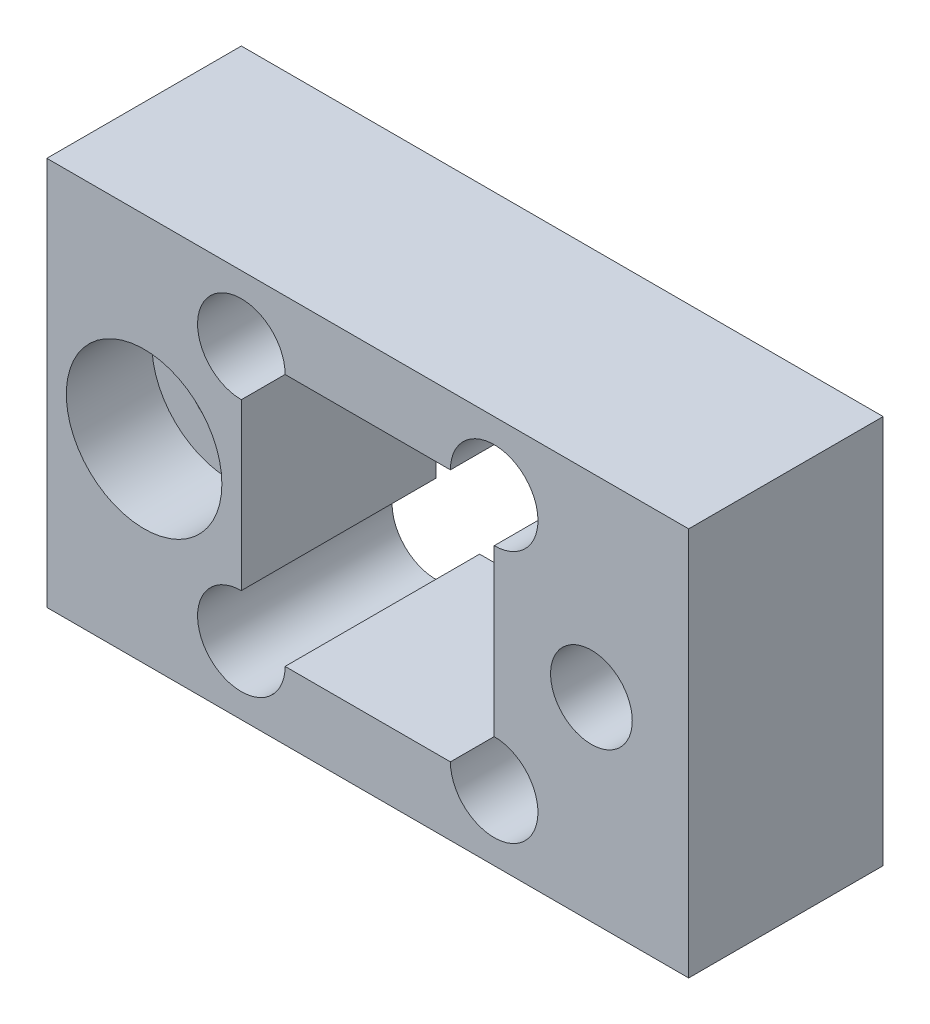
ISO-10303-21;
HEADER;
FILE_DESCRIPTION(('STEP AP214'),'2;1');
FILE_NAME('part.step','',(''),(''),'','','');
FILE_SCHEMA(('AUTOMOTIVE_DESIGN { 1 0 10303 214 1 1 1 1 }'));
ENDSEC;
DATA;
#1=APPLICATION_CONTEXT('core data for automotive mechanical design processes');
#2=APPLICATION_PROTOCOL_DEFINITION('international standard','automotive_design',2000,#1);
#3=PRODUCT_CONTEXT('',#1,'mechanical');
#4=PRODUCT('Part','Part','',(#3));
#5=PRODUCT_RELATED_PRODUCT_CATEGORY('part','',(#4));
#6=PRODUCT_DEFINITION_FORMATION('','',#4);
#7=PRODUCT_DEFINITION_CONTEXT('part definition',#1,'design');
#8=PRODUCT_DEFINITION('design','',#6,#7);
#9=PRODUCT_DEFINITION_SHAPE('','',#8);
#10=(LENGTH_UNIT() NAMED_UNIT(*) SI_UNIT(.MILLI.,.METRE.));
#11=(NAMED_UNIT(*) PLANE_ANGLE_UNIT() SI_UNIT($,.RADIAN.));
#12=(NAMED_UNIT(*) SI_UNIT($,.STERADIAN.) SOLID_ANGLE_UNIT());
#13=UNCERTAINTY_MEASURE_WITH_UNIT(LENGTH_MEASURE(1.E-05),#10,'distance_accuracy_value','');
#14=(GEOMETRIC_REPRESENTATION_CONTEXT(3) GLOBAL_UNCERTAINTY_ASSIGNED_CONTEXT((#13)) GLOBAL_UNIT_ASSIGNED_CONTEXT((#10,
#11,#12)) REPRESENTATION_CONTEXT('',''));
#15=CARTESIAN_POINT('',(0.,0.,0.));
#16=DIRECTION('',(0.,0.,1.));
#17=DIRECTION('',(1.,0.,0.));
#18=AXIS2_PLACEMENT_3D('',#15,#16,#17);
#19=CARTESIAN_POINT('',(0.,0.,10.));
#20=DIRECTION('',(0.,0.,-1.));
#21=DIRECTION('',(-1.,0.,0.));
#22=AXIS2_PLACEMENT_3D('',#19,#20,#21);
#23=PLANE('',#22);
#24=CARTESIAN_POINT('',(11.5,0.,10.));
#25=DIRECTION('',(0.,0.,1.));
#26=DIRECTION('',(1.,0.,0.));
#27=AXIS2_PLACEMENT_3D('',#24,#25,#26);
#28=CIRCLE('',#27,2.09999999999999);
#29=CARTESIAN_POINT('',(13.6,0.,10.));
#30=VERTEX_POINT('',#29);
#31=EDGE_CURVE('E241',#30,#30,#28,.T.);
#32=ORIENTED_EDGE('',*,*,#31,.F.);
#33=EDGE_LOOP('',(#32));
#34=FACE_BOUND('',#33,.T.);
#35=CARTESIAN_POINT('',(-11.5,0.,10.));
#36=DIRECTION('',(0.,0.,1.));
#37=DIRECTION('',(1.,0.,0.));
#38=AXIS2_PLACEMENT_3D('',#35,#36,#37);
#39=CIRCLE('',#38,4.);
#40=CARTESIAN_POINT('',(-7.5,0.,10.));
#41=VERTEX_POINT('',#40);
#42=EDGE_CURVE('E220',#41,#41,#39,.T.);
#43=ORIENTED_EDGE('',*,*,#42,.F.);
#44=EDGE_LOOP('',(#43));
#45=FACE_BOUND('',#44,.T.);
#46=DIRECTION('',(0.,-1.,0.));
#47=VECTOR('',#46,1.);
#48=CARTESIAN_POINT('',(-16.5,-10.,10.));
#49=LINE('',#48,#47);
#50=CARTESIAN_POINT('',(-16.5,10.,10.));
#51=VERTEX_POINT('',#50);
#52=CARTESIAN_POINT('',(-16.5,-10.,10.));
#53=VERTEX_POINT('',#52);
#54=EDGE_CURVE('E170',#51,#53,#49,.T.);
#55=ORIENTED_EDGE('',*,*,#54,.T.);
#56=DIRECTION('',(1.,0.,0.));
#57=VECTOR('',#56,1.);
#58=CARTESIAN_POINT('',(-16.5,-10.,10.));
#59=LINE('',#58,#57);
#60=CARTESIAN_POINT('',(16.5,-10.,10.));
#61=VERTEX_POINT('',#60);
#62=EDGE_CURVE('E173',#53,#61,#59,.T.);
#63=ORIENTED_EDGE('',*,*,#62,.T.);
#64=DIRECTION('',(0.,1.,0.));
#65=VECTOR('',#64,1.);
#66=CARTESIAN_POINT('',(16.5,-10.,10.));
#67=LINE('',#66,#65);
#68=CARTESIAN_POINT('',(16.5,10.,10.));
#69=VERTEX_POINT('',#68);
#70=EDGE_CURVE('E176',#61,#69,#67,.T.);
#71=ORIENTED_EDGE('',*,*,#70,.T.);
#72=DIRECTION('',(-1.,0.,0.));
#73=VECTOR('',#72,1.);
#74=CARTESIAN_POINT('',(-16.5,10.,10.));
#75=LINE('',#74,#73);
#76=EDGE_CURVE('E178',#69,#51,#75,.T.);
#77=ORIENTED_EDGE('',*,*,#76,.T.);
#78=EDGE_LOOP('',(#55,#63,#71,#77));
#79=FACE_BOUND('',#78,.T.);
#80=DIRECTION('',(-1.,0.,0.));
#81=VECTOR('',#80,1.);
#82=CARTESIAN_POINT('',(-6.5,6.5,10.));
#83=LINE('',#82,#81);
#84=CARTESIAN_POINT('',(4.24999999999999,6.5,10.));
#85=VERTEX_POINT('',#84);
#86=CARTESIAN_POINT('',(-4.25,6.5,10.));
#87=VERTEX_POINT('',#86);
#88=EDGE_CURVE('E149',#85,#87,#83,.T.);
#89=ORIENTED_EDGE('',*,*,#88,.F.);
#90=CARTESIAN_POINT('',(6.5,6.5,10.));
#91=DIRECTION('',(0.,0.,1.));
#92=DIRECTION('',(1.,0.,0.));
#93=AXIS2_PLACEMENT_3D('',#90,#91,#92);
#94=CIRCLE('',#93,2.25);
#95=CARTESIAN_POINT('',(6.5,4.25,10.));
#96=VERTEX_POINT('',#95);
#97=EDGE_CURVE('E51',#96,#85,#94,.T.);
#98=ORIENTED_EDGE('',*,*,#97,.F.);
#99=DIRECTION('',(0.,1.,0.));
#100=VECTOR('',#99,1.);
#101=CARTESIAN_POINT('',(6.5,6.5,10.));
#102=LINE('',#101,#100);
#103=CARTESIAN_POINT('',(6.5,-4.25,10.));
#104=VERTEX_POINT('',#103);
#105=EDGE_CURVE('E154',#104,#96,#102,.T.);
#106=ORIENTED_EDGE('',*,*,#105,.F.);
#107=CARTESIAN_POINT('',(6.5,-6.5,10.));
#108=DIRECTION('',(0.,0.,1.));
#109=DIRECTION('',(1.,0.,0.));
#110=AXIS2_PLACEMENT_3D('',#107,#108,#109);
#111=CIRCLE('',#110,2.25);
#112=CARTESIAN_POINT('',(4.25,-6.5,10.));
#113=VERTEX_POINT('',#112);
#114=EDGE_CURVE('E237',#113,#104,#111,.T.);
#115=ORIENTED_EDGE('',*,*,#114,.F.);
#116=DIRECTION('',(1.,0.,0.));
#117=VECTOR('',#116,1.);
#118=CARTESIAN_POINT('',(-6.5,-6.5,10.));
#119=LINE('',#118,#117);
#120=CARTESIAN_POINT('',(-4.25,-6.5,10.));
#121=VERTEX_POINT('',#120);
#122=EDGE_CURVE('E145',#121,#113,#119,.T.);
#123=ORIENTED_EDGE('',*,*,#122,.F.);
#124=CARTESIAN_POINT('',(-6.5,-6.5,10.));
#125=DIRECTION('',(0.,0.,1.));
#126=DIRECTION('',(1.,0.,0.));
#127=AXIS2_PLACEMENT_3D('',#124,#125,#126);
#128=CIRCLE('',#127,2.25);
#129=CARTESIAN_POINT('',(-6.5,-4.25,10.));
#130=VERTEX_POINT('',#129);
#131=EDGE_CURVE('E127',#130,#121,#128,.T.);
#132=ORIENTED_EDGE('',*,*,#131,.F.);
#133=DIRECTION('',(0.,-1.,0.));
#134=VECTOR('',#133,1.);
#135=CARTESIAN_POINT('',(-6.5,6.5,10.));
#136=LINE('',#135,#134);
#137=CARTESIAN_POINT('',(-6.5,4.25,10.));
#138=VERTEX_POINT('',#137);
#139=EDGE_CURVE('E142',#138,#130,#136,.T.);
#140=ORIENTED_EDGE('',*,*,#139,.F.);
#141=CARTESIAN_POINT('',(-6.5,6.5,10.));
#142=DIRECTION('',(0.,0.,1.));
#143=DIRECTION('',(1.,0.,0.));
#144=AXIS2_PLACEMENT_3D('',#141,#142,#143);
#145=CIRCLE('',#144,2.25);
#146=EDGE_CURVE('E59',#87,#138,#145,.T.);
#147=ORIENTED_EDGE('',*,*,#146,.F.);
#148=EDGE_LOOP('',(#89,#98,#106,#115,#123,#132,#140,#147));
#149=FACE_BOUND('',#148,.T.);
#150=ADVANCED_FACE('F37',(#34,#45,#79,#149),#23,.F.);
#151=CARTESIAN_POINT('',(0.,0.,0.));
#152=DIRECTION('',(0.,0.,-1.));
#153=DIRECTION('',(-1.,0.,0.));
#154=AXIS2_PLACEMENT_3D('',#151,#152,#153);
#155=PLANE('',#154);
#156=CARTESIAN_POINT('',(11.5,0.,0.));
#157=DIRECTION('',(0.,0.,1.));
#158=DIRECTION('',(1.,0.,0.));
#159=AXIS2_PLACEMENT_3D('',#156,#157,#158);
#160=CIRCLE('',#159,2.1);
#161=CARTESIAN_POINT('',(13.6,0.,0.));
#162=VERTEX_POINT('',#161);
#163=EDGE_CURVE('E239',#162,#162,#160,.T.);
#164=ORIENTED_EDGE('',*,*,#163,.T.);
#165=EDGE_LOOP('',(#164));
#166=FACE_BOUND('',#165,.T.);
#167=CARTESIAN_POINT('',(6.5,6.5,0.));
#168=DIRECTION('',(0.,0.,1.));
#169=DIRECTION('',(1.,0.,0.));
#170=AXIS2_PLACEMENT_3D('',#167,#168,#169);
#171=CIRCLE('',#170,2.25);
#172=CARTESIAN_POINT('',(6.5,4.25,0.));
#173=VERTEX_POINT('',#172);
#174=CARTESIAN_POINT('',(4.25,6.5,0.));
#175=VERTEX_POINT('',#174);
#176=EDGE_CURVE('E238',#173,#175,#171,.T.);
#177=ORIENTED_EDGE('',*,*,#176,.T.);
#178=DIRECTION('',(-1.,0.,0.));
#179=VECTOR('',#178,1.);
#180=CARTESIAN_POINT('',(-6.5,6.5,0.));
#181=LINE('',#180,#179);
#182=CARTESIAN_POINT('',(-4.25,6.5,0.));
#183=VERTEX_POINT('',#182);
#184=EDGE_CURVE('E161',#175,#183,#181,.T.);
#185=ORIENTED_EDGE('',*,*,#184,.T.);
#186=CARTESIAN_POINT('',(-6.5,6.5,0.));
#187=DIRECTION('',(0.,0.,1.));
#188=DIRECTION('',(1.,0.,0.));
#189=AXIS2_PLACEMENT_3D('',#186,#187,#188);
#190=CIRCLE('',#189,2.25);
#191=CARTESIAN_POINT('',(-6.5,4.25,0.));
#192=VERTEX_POINT('',#191);
#193=EDGE_CURVE('E136',#183,#192,#190,.T.);
#194=ORIENTED_EDGE('',*,*,#193,.T.);
#195=DIRECTION('',(0.,-1.,0.));
#196=VECTOR('',#195,1.);
#197=CARTESIAN_POINT('',(-6.5,6.5,0.));
#198=LINE('',#197,#196);
#199=CARTESIAN_POINT('',(-6.5,-4.25,0.));
#200=VERTEX_POINT('',#199);
#201=EDGE_CURVE('E165',#192,#200,#198,.T.);
#202=ORIENTED_EDGE('',*,*,#201,.T.);
#203=CARTESIAN_POINT('',(-6.5,-6.5,0.));
#204=DIRECTION('',(0.,0.,1.));
#205=DIRECTION('',(1.,0.,0.));
#206=AXIS2_PLACEMENT_3D('',#203,#204,#205);
#207=CIRCLE('',#206,2.25);
#208=CARTESIAN_POINT('',(-4.25,-6.5,0.));
#209=VERTEX_POINT('',#208);
#210=EDGE_CURVE('E130',#200,#209,#207,.T.);
#211=ORIENTED_EDGE('',*,*,#210,.T.);
#212=DIRECTION('',(1.,0.,0.));
#213=VECTOR('',#212,1.);
#214=CARTESIAN_POINT('',(-6.5,-6.5,0.));
#215=LINE('',#214,#213);
#216=CARTESIAN_POINT('',(4.25,-6.5,0.));
#217=VERTEX_POINT('',#216);
#218=EDGE_CURVE('E167',#209,#217,#215,.T.);
#219=ORIENTED_EDGE('',*,*,#218,.T.);
#220=CARTESIAN_POINT('',(6.5,-6.5,0.));
#221=DIRECTION('',(0.,0.,1.));
#222=DIRECTION('',(1.,0.,0.));
#223=AXIS2_PLACEMENT_3D('',#220,#221,#222);
#224=CIRCLE('',#223,2.25);
#225=CARTESIAN_POINT('',(6.5,-4.25,0.));
#226=VERTEX_POINT('',#225);
#227=EDGE_CURVE('E146',#217,#226,#224,.T.);
#228=ORIENTED_EDGE('',*,*,#227,.T.);
#229=DIRECTION('',(0.,1.,0.));
#230=VECTOR('',#229,1.);
#231=CARTESIAN_POINT('',(6.5,6.5,0.));
#232=LINE('',#231,#230);
#233=EDGE_CURVE('E158',#226,#173,#232,.T.);
#234=ORIENTED_EDGE('',*,*,#233,.T.);
#235=EDGE_LOOP('',(#177,#185,#194,#202,#211,#219,#228,#234));
#236=FACE_BOUND('',#235,.T.);
#237=CARTESIAN_POINT('',(-11.5,0.,0.));
#238=DIRECTION('',(0.,0.,1.));
#239=DIRECTION('',(1.,0.,0.));
#240=AXIS2_PLACEMENT_3D('',#237,#238,#239);
#241=CIRCLE('',#240,2.25);
#242=CARTESIAN_POINT('',(-9.25,0.,0.));
#243=VERTEX_POINT('',#242);
#244=EDGE_CURVE('E162',#243,#243,#241,.T.);
#245=ORIENTED_EDGE('',*,*,#244,.T.);
#246=EDGE_LOOP('',(#245));
#247=FACE_BOUND('',#246,.T.);
#248=DIRECTION('',(0.,-1.,0.));
#249=VECTOR('',#248,1.);
#250=CARTESIAN_POINT('',(-16.5,-10.,0.));
#251=LINE('',#250,#249);
#252=CARTESIAN_POINT('',(-16.5,10.,0.));
#253=VERTEX_POINT('',#252);
#254=CARTESIAN_POINT('',(-16.5,-10.,0.));
#255=VERTEX_POINT('',#254);
#256=EDGE_CURVE('E151',#253,#255,#251,.T.);
#257=ORIENTED_EDGE('',*,*,#256,.F.);
#258=DIRECTION('',(-1.,0.,0.));
#259=VECTOR('',#258,1.);
#260=CARTESIAN_POINT('',(-16.5,10.,0.));
#261=LINE('',#260,#259);
#262=CARTESIAN_POINT('',(16.5,10.,0.));
#263=VERTEX_POINT('',#262);
#264=EDGE_CURVE('E174',#263,#253,#261,.T.);
#265=ORIENTED_EDGE('',*,*,#264,.F.);
#266=DIRECTION('',(0.,1.,0.));
#267=VECTOR('',#266,1.);
#268=CARTESIAN_POINT('',(16.5,-10.,0.));
#269=LINE('',#268,#267);
#270=CARTESIAN_POINT('',(16.5,-10.,0.));
#271=VERTEX_POINT('',#270);
#272=EDGE_CURVE('E185',#271,#263,#269,.T.);
#273=ORIENTED_EDGE('',*,*,#272,.F.);
#274=DIRECTION('',(1.,0.,0.));
#275=VECTOR('',#274,1.);
#276=CARTESIAN_POINT('',(-16.5,-10.,0.));
#277=LINE('',#276,#275);
#278=EDGE_CURVE('E183',#255,#271,#277,.T.);
#279=ORIENTED_EDGE('',*,*,#278,.F.);
#280=EDGE_LOOP('',(#257,#265,#273,#279));
#281=FACE_BOUND('',#280,.T.);
#282=ADVANCED_FACE('F207',(#166,#236,#247,#281),#155,.T.);
#283=CARTESIAN_POINT('',(-16.5,-10.,10.));
#284=DIRECTION('',(1.,0.,0.));
#285=DIRECTION('',(0.,0.,-1.));
#286=AXIS2_PLACEMENT_3D('',#283,#284,#285);
#287=PLANE('',#286);
#288=ORIENTED_EDGE('',*,*,#256,.T.);
#289=DIRECTION('',(0.,0.,-1.));
#290=VECTOR('',#289,1.);
#291=CARTESIAN_POINT('',(-16.5,-10.,10.));
#292=LINE('',#291,#290);
#293=EDGE_CURVE('E196',#53,#255,#292,.T.);
#294=ORIENTED_EDGE('',*,*,#293,.F.);
#295=ORIENTED_EDGE('',*,*,#54,.F.);
#296=DIRECTION('',(0.,0.,-1.));
#297=VECTOR('',#296,1.);
#298=CARTESIAN_POINT('',(-16.5,10.,10.));
#299=LINE('',#298,#297);
#300=EDGE_CURVE('E180',#51,#253,#299,.T.);
#301=ORIENTED_EDGE('',*,*,#300,.T.);
#302=EDGE_LOOP('',(#288,#294,#295,#301));
#303=FACE_BOUND('',#302,.T.);
#304=ADVANCED_FACE('F39',(#303),#287,.F.);
#305=CARTESIAN_POINT('',(-16.5,-10.,10.));
#306=DIRECTION('',(0.,1.,0.));
#307=DIRECTION('',(0.,0.,1.));
#308=AXIS2_PLACEMENT_3D('',#305,#306,#307);
#309=PLANE('',#308);
#310=ORIENTED_EDGE('',*,*,#278,.T.);
#311=DIRECTION('',(0.,0.,-1.));
#312=VECTOR('',#311,1.);
#313=CARTESIAN_POINT('',(16.5,-10.,10.));
#314=LINE('',#313,#312);
#315=EDGE_CURVE('E193',#61,#271,#314,.T.);
#316=ORIENTED_EDGE('',*,*,#315,.F.);
#317=ORIENTED_EDGE('',*,*,#62,.F.);
#318=ORIENTED_EDGE('',*,*,#293,.T.);
#319=EDGE_LOOP('',(#310,#316,#317,#318));
#320=FACE_BOUND('',#319,.T.);
#321=ADVANCED_FACE('F290',(#320),#309,.F.);
#322=CARTESIAN_POINT('',(16.5,-10.,10.));
#323=DIRECTION('',(-1.,0.,0.));
#324=DIRECTION('',(0.,0.,1.));
#325=AXIS2_PLACEMENT_3D('',#322,#323,#324);
#326=PLANE('',#325);
#327=ORIENTED_EDGE('',*,*,#272,.T.);
#328=DIRECTION('',(0.,0.,-1.));
#329=VECTOR('',#328,1.);
#330=CARTESIAN_POINT('',(16.5,10.,10.));
#331=LINE('',#330,#329);
#332=EDGE_CURVE('E190',#69,#263,#331,.T.);
#333=ORIENTED_EDGE('',*,*,#332,.F.);
#334=ORIENTED_EDGE('',*,*,#70,.F.);
#335=ORIENTED_EDGE('',*,*,#315,.T.);
#336=EDGE_LOOP('',(#327,#333,#334,#335));
#337=FACE_BOUND('',#336,.T.);
#338=ADVANCED_FACE('F287',(#337),#326,.F.);
#339=CARTESIAN_POINT('',(-16.5,10.,10.));
#340=DIRECTION('',(0.,-1.,0.));
#341=DIRECTION('',(0.,0.,-1.));
#342=AXIS2_PLACEMENT_3D('',#339,#340,#341);
#343=PLANE('',#342);
#344=ORIENTED_EDGE('',*,*,#264,.T.);
#345=ORIENTED_EDGE('',*,*,#300,.F.);
#346=ORIENTED_EDGE('',*,*,#76,.F.);
#347=ORIENTED_EDGE('',*,*,#332,.T.);
#348=EDGE_LOOP('',(#344,#345,#346,#347));
#349=FACE_BOUND('',#348,.T.);
#350=ADVANCED_FACE('F284',(#349),#343,.F.);
#351=CARTESIAN_POINT('',(6.5,6.5,10.));
#352=DIRECTION('',(-1.,0.,0.));
#353=DIRECTION('',(0.,-1.,0.));
#354=AXIS2_PLACEMENT_3D('',#351,#352,#353);
#355=PLANE('',#354);
#356=DIRECTION('',(0.,0.,1.));
#357=VECTOR('',#356,1.);
#358=CARTESIAN_POINT('',(6.5,4.25,0.));
#359=LINE('',#358,#357);
#360=EDGE_CURVE('E218',#173,#96,#359,.T.);
#361=ORIENTED_EDGE('',*,*,#360,.F.);
#362=ORIENTED_EDGE('',*,*,#233,.F.);
#363=DIRECTION('',(0.,0.,1.));
#364=VECTOR('',#363,1.);
#365=CARTESIAN_POINT('',(6.5,-4.25,0.));
#366=LINE('',#365,#364);
#367=EDGE_CURVE('E135',#104,#226,#366,.F.);
#368=ORIENTED_EDGE('',*,*,#367,.F.);
#369=ORIENTED_EDGE('',*,*,#105,.T.);
#370=EDGE_LOOP('',(#361,#362,#368,#369));
#371=FACE_BOUND('',#370,.T.);
#372=ADVANCED_FACE('F235',(#371),#355,.T.);
#373=CARTESIAN_POINT('',(-6.5,6.5,10.));
#374=DIRECTION('',(0.,-1.,0.));
#375=DIRECTION('',(0.,0.,-1.));
#376=AXIS2_PLACEMENT_3D('',#373,#374,#375);
#377=PLANE('',#376);
#378=DIRECTION('',(0.,0.,1.));
#379=VECTOR('',#378,1.);
#380=CARTESIAN_POINT('',(4.25,6.5,0.));
#381=LINE('',#380,#379);
#382=EDGE_CURVE('E11',#85,#175,#381,.F.);
#383=ORIENTED_EDGE('',*,*,#382,.F.);
#384=ORIENTED_EDGE('',*,*,#88,.T.);
#385=DIRECTION('',(0.,0.,1.));
#386=VECTOR('',#385,1.);
#387=CARTESIAN_POINT('',(-4.25,6.5,0.));
#388=LINE('',#387,#386);
#389=EDGE_CURVE('E216',#183,#87,#388,.T.);
#390=ORIENTED_EDGE('',*,*,#389,.F.);
#391=ORIENTED_EDGE('',*,*,#184,.F.);
#392=EDGE_LOOP('',(#383,#384,#390,#391));
#393=FACE_BOUND('',#392,.T.);
#394=ADVANCED_FACE('F258',(#393),#377,.T.);
#395=CARTESIAN_POINT('',(-6.5,6.5,10.));
#396=DIRECTION('',(1.,0.,0.));
#397=DIRECTION('',(0.,1.,0.));
#398=AXIS2_PLACEMENT_3D('',#395,#396,#397);
#399=PLANE('',#398);
#400=DIRECTION('',(0.,0.,1.));
#401=VECTOR('',#400,1.);
#402=CARTESIAN_POINT('',(-6.5,-4.25,0.));
#403=LINE('',#402,#401);
#404=EDGE_CURVE('E124',#200,#130,#403,.T.);
#405=ORIENTED_EDGE('',*,*,#404,.F.);
#406=ORIENTED_EDGE('',*,*,#201,.F.);
#407=DIRECTION('',(0.,0.,1.));
#408=VECTOR('',#407,1.);
#409=CARTESIAN_POINT('',(-6.5,4.25,0.));
#410=LINE('',#409,#408);
#411=EDGE_CURVE('E45',#138,#192,#410,.F.);
#412=ORIENTED_EDGE('',*,*,#411,.F.);
#413=ORIENTED_EDGE('',*,*,#139,.T.);
#414=EDGE_LOOP('',(#405,#406,#412,#413));
#415=FACE_BOUND('',#414,.T.);
#416=ADVANCED_FACE('F148',(#415),#399,.T.);
#417=CARTESIAN_POINT('',(-6.5,-6.5,10.));
#418=DIRECTION('',(0.,1.,0.));
#419=DIRECTION('',(0.,0.,1.));
#420=AXIS2_PLACEMENT_3D('',#417,#418,#419);
#421=PLANE('',#420);
#422=DIRECTION('',(0.,0.,1.));
#423=VECTOR('',#422,1.);
#424=CARTESIAN_POINT('',(4.25,-6.5,0.));
#425=LINE('',#424,#423);
#426=EDGE_CURVE('E201',#217,#113,#425,.T.);
#427=ORIENTED_EDGE('',*,*,#426,.F.);
#428=ORIENTED_EDGE('',*,*,#218,.F.);
#429=DIRECTION('',(0.,0.,1.));
#430=VECTOR('',#429,1.);
#431=CARTESIAN_POINT('',(-4.25,-6.5,0.));
#432=LINE('',#431,#430);
#433=EDGE_CURVE('E199',#121,#209,#432,.F.);
#434=ORIENTED_EDGE('',*,*,#433,.F.);
#435=ORIENTED_EDGE('',*,*,#122,.T.);
#436=EDGE_LOOP('',(#427,#428,#434,#435));
#437=FACE_BOUND('',#436,.T.);
#438=ADVANCED_FACE('F256',(#437),#421,.T.);
#439=CARTESIAN_POINT('',(-11.5,0.,10.));
#440=DIRECTION('',(0.,0.,1.));
#441=DIRECTION('',(1.,0.,0.));
#442=AXIS2_PLACEMENT_3D('',#439,#440,#441);
#443=CYLINDRICAL_SURFACE('',#442,2.25);
#444=ORIENTED_EDGE('',*,*,#244,.F.);
#445=EDGE_LOOP('',(#444));
#446=FACE_BOUND('',#445,.T.);
#447=CARTESIAN_POINT('',(-11.5,0.,5.6));
#448=DIRECTION('',(0.,0.,1.));
#449=DIRECTION('',(1.,0.,0.));
#450=AXIS2_PLACEMENT_3D('',#447,#448,#449);
#451=CIRCLE('',#450,2.25);
#452=CARTESIAN_POINT('',(-9.25,0.,5.6));
#453=VERTEX_POINT('',#452);
#454=EDGE_CURVE('E226',#453,#453,#451,.T.);
#455=ORIENTED_EDGE('',*,*,#454,.T.);
#456=EDGE_LOOP('',(#455));
#457=FACE_BOUND('',#456,.T.);
#458=ADVANCED_FACE('F360',(#446,#457),#443,.F.);
#459=CARTESIAN_POINT('',(-9.25,0.,5.6));
#460=DIRECTION('',(0.,0.,-1.));
#461=DIRECTION('',(-1.,0.,0.));
#462=AXIS2_PLACEMENT_3D('',#459,#460,#461);
#463=PLANE('',#462);
#464=ORIENTED_EDGE('',*,*,#454,.F.);
#465=EDGE_LOOP('',(#464));
#466=FACE_BOUND('',#465,.T.);
#467=CARTESIAN_POINT('',(-11.5,0.,5.6));
#468=DIRECTION('',(0.,0.,1.));
#469=DIRECTION('',(1.,0.,0.));
#470=AXIS2_PLACEMENT_3D('',#467,#468,#469);
#471=CIRCLE('',#470,4.);
#472=CARTESIAN_POINT('',(-7.5,0.,5.6));
#473=VERTEX_POINT('',#472);
#474=EDGE_CURVE('E223',#473,#473,#471,.T.);
#475=ORIENTED_EDGE('',*,*,#474,.T.);
#476=EDGE_LOOP('',(#475));
#477=FACE_BOUND('',#476,.T.);
#478=ADVANCED_FACE('F383',(#466,#477),#463,.F.);
#479=CARTESIAN_POINT('',(-11.5,0.,10.));
#480=DIRECTION('',(0.,0.,1.));
#481=DIRECTION('',(1.,0.,0.));
#482=AXIS2_PLACEMENT_3D('',#479,#480,#481);
#483=CYLINDRICAL_SURFACE('',#482,4.);
#484=ORIENTED_EDGE('',*,*,#474,.F.);
#485=EDGE_LOOP('',(#484));
#486=FACE_BOUND('',#485,.T.);
#487=ORIENTED_EDGE('',*,*,#42,.T.);
#488=EDGE_LOOP('',(#487));
#489=FACE_BOUND('',#488,.T.);
#490=ADVANCED_FACE('F350',(#486,#489),#483,.F.);
#491=CARTESIAN_POINT('',(-6.5,-6.5,0.));
#492=DIRECTION('',(0.,0.,1.));
#493=DIRECTION('',(1.,0.,0.));
#494=AXIS2_PLACEMENT_3D('',#491,#492,#493);
#495=CYLINDRICAL_SURFACE('',#494,2.25);
#496=ORIENTED_EDGE('',*,*,#404,.T.);
#497=ORIENTED_EDGE('',*,*,#131,.T.);
#498=ORIENTED_EDGE('',*,*,#433,.T.);
#499=ORIENTED_EDGE('',*,*,#210,.F.);
#500=EDGE_LOOP('',(#496,#497,#498,#499));
#501=FACE_BOUND('',#500,.T.);
#502=ADVANCED_FACE('F126',(#501),#495,.F.);
#503=CARTESIAN_POINT('',(6.5,-6.5,0.));
#504=DIRECTION('',(0.,0.,1.));
#505=DIRECTION('',(1.,0.,0.));
#506=AXIS2_PLACEMENT_3D('',#503,#504,#505);
#507=CYLINDRICAL_SURFACE('',#506,2.25);
#508=ORIENTED_EDGE('',*,*,#367,.T.);
#509=ORIENTED_EDGE('',*,*,#227,.F.);
#510=ORIENTED_EDGE('',*,*,#426,.T.);
#511=ORIENTED_EDGE('',*,*,#114,.T.);
#512=EDGE_LOOP('',(#508,#509,#510,#511));
#513=FACE_BOUND('',#512,.T.);
#514=ADVANCED_FACE('F252',(#513),#507,.F.);
#515=CARTESIAN_POINT('',(-6.5,6.5,0.));
#516=DIRECTION('',(0.,0.,1.));
#517=DIRECTION('',(1.,0.,0.));
#518=AXIS2_PLACEMENT_3D('',#515,#516,#517);
#519=CYLINDRICAL_SURFACE('',#518,2.25);
#520=ORIENTED_EDGE('',*,*,#389,.T.);
#521=ORIENTED_EDGE('',*,*,#146,.T.);
#522=ORIENTED_EDGE('',*,*,#411,.T.);
#523=ORIENTED_EDGE('',*,*,#193,.F.);
#524=EDGE_LOOP('',(#520,#521,#522,#523));
#525=FACE_BOUND('',#524,.T.);
#526=ADVANCED_FACE('F203',(#525),#519,.F.);
#527=CARTESIAN_POINT('',(6.5,6.5,0.));
#528=DIRECTION('',(0.,0.,1.));
#529=DIRECTION('',(1.,0.,0.));
#530=AXIS2_PLACEMENT_3D('',#527,#528,#529);
#531=CYLINDRICAL_SURFACE('',#530,2.25);
#532=ORIENTED_EDGE('',*,*,#360,.T.);
#533=ORIENTED_EDGE('',*,*,#97,.T.);
#534=ORIENTED_EDGE('',*,*,#382,.T.);
#535=ORIENTED_EDGE('',*,*,#176,.F.);
#536=EDGE_LOOP('',(#532,#533,#534,#535));
#537=FACE_BOUND('',#536,.T.);
#538=ADVANCED_FACE('F259',(#537),#531,.F.);
#539=CARTESIAN_POINT('',(11.5,0.,10.));
#540=DIRECTION('',(0.,0.,1.));
#541=DIRECTION('',(1.,0.,0.));
#542=AXIS2_PLACEMENT_3D('',#539,#540,#541);
#543=CYLINDRICAL_SURFACE('',#542,2.09999999999999);
#544=ORIENTED_EDGE('',*,*,#163,.F.);
#545=EDGE_LOOP('',(#544));
#546=FACE_BOUND('',#545,.T.);
#547=ORIENTED_EDGE('',*,*,#31,.T.);
#548=EDGE_LOOP('',(#547));
#549=FACE_BOUND('',#548,.T.);
#550=ADVANCED_FACE('F261',(#546,#549),#543,.F.);
#551=CLOSED_SHELL('',(#150,#282,#304,#321,#338,#350,#372,#394,#416,#438,#458,#478,#490,#502,
#514,#526,#538,#550));
#552=MANIFOLD_SOLID_BREP('B2',#551);
#553=ADVANCED_BREP_SHAPE_REPRESENTATION('',(#18,#552),#14);
#554=SHAPE_DEFINITION_REPRESENTATION(#9,#553);
ENDSEC;
END-ISO-10303-21;
